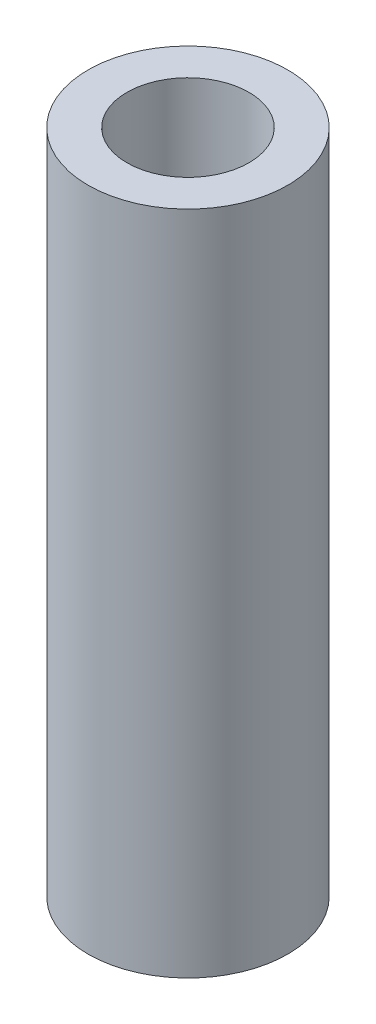
ISO-10303-21;
HEADER;
FILE_DESCRIPTION(('STEP AP214'),'2;1');
FILE_NAME('part.step','',(''),(''),'','','');
FILE_SCHEMA(('AUTOMOTIVE_DESIGN { 1 0 10303 214 1 1 1 1 }'));
ENDSEC;
DATA;
#1=APPLICATION_CONTEXT('core data for automotive mechanical design processes');
#2=APPLICATION_PROTOCOL_DEFINITION('international standard','automotive_design',2000,#1);
#3=PRODUCT_CONTEXT('',#1,'mechanical');
#4=PRODUCT('Part','Part','',(#3));
#5=PRODUCT_RELATED_PRODUCT_CATEGORY('part','',(#4));
#6=PRODUCT_DEFINITION_FORMATION('','',#4);
#7=PRODUCT_DEFINITION_CONTEXT('part definition',#1,'design');
#8=PRODUCT_DEFINITION('design','',#6,#7);
#9=PRODUCT_DEFINITION_SHAPE('','',#8);
#10=(LENGTH_UNIT() NAMED_UNIT(*) SI_UNIT(.MILLI.,.METRE.));
#11=(NAMED_UNIT(*) PLANE_ANGLE_UNIT() SI_UNIT($,.RADIAN.));
#12=(NAMED_UNIT(*) SI_UNIT($,.STERADIAN.) SOLID_ANGLE_UNIT());
#13=UNCERTAINTY_MEASURE_WITH_UNIT(LENGTH_MEASURE(1.E-05),#10,'distance_accuracy_value','');
#14=(GEOMETRIC_REPRESENTATION_CONTEXT(3) GLOBAL_UNCERTAINTY_ASSIGNED_CONTEXT((#13)) GLOBAL_UNIT_ASSIGNED_CONTEXT((#10,
#11,#12)) REPRESENTATION_CONTEXT('',''));
#15=CARTESIAN_POINT('',(0.,0.,0.));
#16=DIRECTION('',(0.,0.,1.));
#17=DIRECTION('',(1.,0.,0.));
#18=AXIS2_PLACEMENT_3D('',#15,#16,#17);
#19=CARTESIAN_POINT('',(0.,30.,0.));
#20=DIRECTION('',(0.,1.,0.));
#21=DIRECTION('',(0.,0.,1.));
#22=AXIS2_PLACEMENT_3D('',#19,#20,#21);
#23=PLANE('',#22);
#24=CARTESIAN_POINT('',(0.,30.,0.));
#25=DIRECTION('',(0.,1.,0.));
#26=DIRECTION('',(0.,0.,1.));
#27=AXIS2_PLACEMENT_3D('',#24,#25,#26);
#28=CIRCLE('',#27,4.5);
#29=CARTESIAN_POINT('',(0.,30.,4.5));
#30=VERTEX_POINT('',#29);
#31=EDGE_CURVE('E10',#30,#30,#28,.T.);
#32=ORIENTED_EDGE('',*,*,#31,.T.);
#33=EDGE_LOOP('',(#32));
#34=FACE_BOUND('',#33,.T.);
#35=CARTESIAN_POINT('',(0.,30.,0.));
#36=DIRECTION('',(0.,1.,0.));
#37=DIRECTION('',(0.,0.,1.));
#38=AXIS2_PLACEMENT_3D('',#35,#36,#37);
#39=CIRCLE('',#38,2.75);
#40=CARTESIAN_POINT('',(0.,30.,2.75));
#41=VERTEX_POINT('',#40);
#42=EDGE_CURVE('E46',#41,#41,#39,.T.);
#43=ORIENTED_EDGE('',*,*,#42,.F.);
#44=EDGE_LOOP('',(#43));
#45=FACE_BOUND('',#44,.T.);
#46=ADVANCED_FACE('F35',(#34,#45),#23,.T.);
#47=CARTESIAN_POINT('',(0.,0.,0.));
#48=DIRECTION('',(0.,1.,0.));
#49=DIRECTION('',(0.,0.,1.));
#50=AXIS2_PLACEMENT_3D('',#47,#48,#49);
#51=PLANE('',#50);
#52=CARTESIAN_POINT('',(0.,0.,0.));
#53=DIRECTION('',(0.,1.,0.));
#54=DIRECTION('',(0.,0.,1.));
#55=AXIS2_PLACEMENT_3D('',#52,#53,#54);
#56=CIRCLE('',#55,4.5);
#57=CARTESIAN_POINT('',(0.,0.,4.5));
#58=VERTEX_POINT('',#57);
#59=EDGE_CURVE('E39',#58,#58,#56,.T.);
#60=ORIENTED_EDGE('',*,*,#59,.F.);
#61=EDGE_LOOP('',(#60));
#62=FACE_BOUND('',#61,.T.);
#63=CARTESIAN_POINT('',(0.,0.,0.));
#64=DIRECTION('',(0.,1.,0.));
#65=DIRECTION('',(0.,0.,1.));
#66=AXIS2_PLACEMENT_3D('',#63,#64,#65);
#67=CIRCLE('',#66,2.75);
#68=CARTESIAN_POINT('',(0.,0.,2.75));
#69=VERTEX_POINT('',#68);
#70=EDGE_CURVE('E48',#69,#69,#67,.T.);
#71=ORIENTED_EDGE('',*,*,#70,.T.);
#72=EDGE_LOOP('',(#71));
#73=FACE_BOUND('',#72,.T.);
#74=ADVANCED_FACE('F58',(#62,#73),#51,.F.);
#75=CARTESIAN_POINT('',(0.,30.,0.));
#76=DIRECTION('',(0.,-1.,0.));
#77=DIRECTION('',(0.,0.,-1.));
#78=AXIS2_PLACEMENT_3D('',#75,#76,#77);
#79=CYLINDRICAL_SURFACE('',#78,4.5);
#80=ORIENTED_EDGE('',*,*,#31,.F.);
#81=EDGE_LOOP('',(#80));
#82=FACE_BOUND('',#81,.T.);
#83=ORIENTED_EDGE('',*,*,#59,.T.);
#84=EDGE_LOOP('',(#83));
#85=FACE_BOUND('',#84,.T.);
#86=ADVANCED_FACE('F37',(#82,#85),#79,.T.);
#87=CARTESIAN_POINT('',(0.,30.,0.));
#88=DIRECTION('',(0.,-1.,0.));
#89=DIRECTION('',(0.,0.,-1.));
#90=AXIS2_PLACEMENT_3D('',#87,#88,#89);
#91=CYLINDRICAL_SURFACE('',#90,2.75);
#92=ORIENTED_EDGE('',*,*,#42,.T.);
#93=EDGE_LOOP('',(#92));
#94=FACE_BOUND('',#93,.T.);
#95=ORIENTED_EDGE('',*,*,#70,.F.);
#96=EDGE_LOOP('',(#95));
#97=FACE_BOUND('',#96,.T.);
#98=ADVANCED_FACE('F54',(#94,#97),#91,.F.);
#99=CLOSED_SHELL('',(#46,#74,#86,#98));
#100=MANIFOLD_SOLID_BREP('B2',#99);
#101=ADVANCED_BREP_SHAPE_REPRESENTATION('',(#18,#100),#14);
#102=SHAPE_DEFINITION_REPRESENTATION(#9,#101);
ENDSEC;
END-ISO-10303-21;
